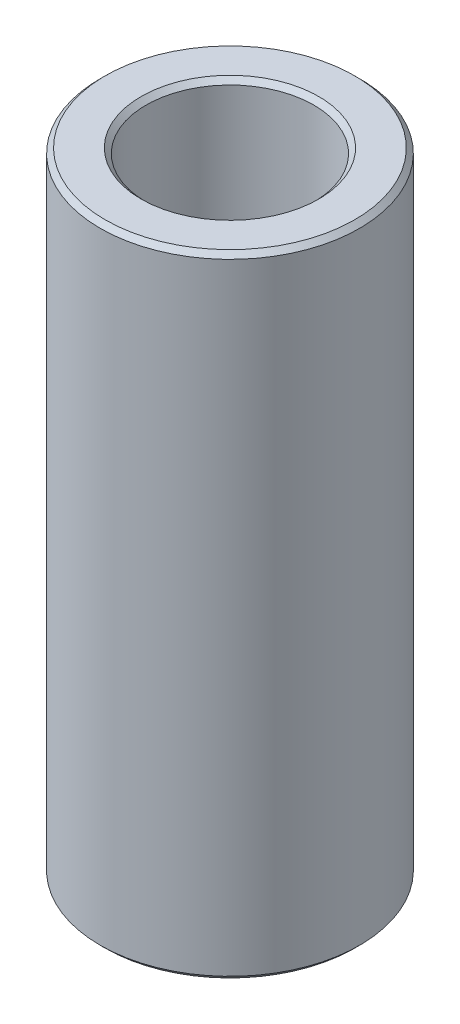
ISO-10303-21;
HEADER;
FILE_DESCRIPTION(('STEP AP214'),'2;1');
FILE_NAME('part.step','',(''),(''),'','','');
FILE_SCHEMA(('AUTOMOTIVE_DESIGN { 1 0 10303 214 1 1 1 1 }'));
ENDSEC;
DATA;
#1=APPLICATION_CONTEXT('core data for automotive mechanical design processes');
#2=APPLICATION_PROTOCOL_DEFINITION('international standard','automotive_design',2000,#1);
#3=PRODUCT_CONTEXT('',#1,'mechanical');
#4=PRODUCT('Part','Part','',(#3));
#5=PRODUCT_RELATED_PRODUCT_CATEGORY('part','',(#4));
#6=PRODUCT_DEFINITION_FORMATION('','',#4);
#7=PRODUCT_DEFINITION_CONTEXT('part definition',#1,'design');
#8=PRODUCT_DEFINITION('design','',#6,#7);
#9=PRODUCT_DEFINITION_SHAPE('','',#8);
#10=(LENGTH_UNIT() NAMED_UNIT(*) SI_UNIT(.MILLI.,.METRE.));
#11=(NAMED_UNIT(*) PLANE_ANGLE_UNIT() SI_UNIT($,.RADIAN.));
#12=(NAMED_UNIT(*) SI_UNIT($,.STERADIAN.) SOLID_ANGLE_UNIT());
#13=UNCERTAINTY_MEASURE_WITH_UNIT(LENGTH_MEASURE(1.E-05),#10,'distance_accuracy_value','');
#14=(GEOMETRIC_REPRESENTATION_CONTEXT(3) GLOBAL_UNCERTAINTY_ASSIGNED_CONTEXT((#13)) GLOBAL_UNIT_ASSIGNED_CONTEXT((#10,
#11,#12)) REPRESENTATION_CONTEXT('',''));
#15=CARTESIAN_POINT('',(0.,0.,0.));
#16=DIRECTION('',(0.,0.,1.));
#17=DIRECTION('',(1.,0.,0.));
#18=AXIS2_PLACEMENT_3D('',#15,#16,#17);
#19=CARTESIAN_POINT('',(0.,279.66699871967,0.));
#20=DIRECTION('',(0.,-1.,0.));
#21=DIRECTION('',(0.,0.,-1.));
#22=AXIS2_PLACEMENT_3D('',#19,#20,#21);
#23=CYLINDRICAL_SURFACE('',#22,57.5);
#24=CARTESIAN_POINT('',(0.,2.19095444456258,0.));
#25=DIRECTION('',(0.,1.,0.));
#26=DIRECTION('',(0.,0.,1.));
#27=AXIS2_PLACEMENT_3D('',#24,#25,#26);
#28=CIRCLE('',#27,57.5);
#29=CARTESIAN_POINT('',(0.,2.19095444456258,57.5));
#30=VERTEX_POINT('',#29);
#31=EDGE_CURVE('E10',#30,#30,#28,.T.);
#32=ORIENTED_EDGE('',*,*,#31,.T.);
#33=EDGE_LOOP('',(#32));
#34=FACE_BOUND('',#33,.T.);
#35=CARTESIAN_POINT('',(0.,277.476044275108,0.));
#36=DIRECTION('',(0.,1.,0.));
#37=DIRECTION('',(0.,0.,1.));
#38=AXIS2_PLACEMENT_3D('',#35,#36,#37);
#39=CIRCLE('',#38,57.5);
#40=CARTESIAN_POINT('',(0.,277.476044275108,57.5));
#41=VERTEX_POINT('',#40);
#42=EDGE_CURVE('E50',#41,#41,#39,.F.);
#43=ORIENTED_EDGE('',*,*,#42,.T.);
#44=EDGE_LOOP('',(#43));
#45=FACE_BOUND('',#44,.T.);
#46=ADVANCED_FACE('F39',(#34,#45),#23,.T.);
#47=CARTESIAN_POINT('',(0.,279.66699871967,0.));
#48=DIRECTION('',(0.,1.,0.));
#49=DIRECTION('',(0.,0.,1.));
#50=AXIS2_PLACEMENT_3D('',#47,#48,#49);
#51=PLANE('',#50);
#52=CARTESIAN_POINT('',(0.,279.66699871967,0.));
#53=DIRECTION('',(0.,1.,0.));
#54=DIRECTION('',(0.,0.,1.));
#55=AXIS2_PLACEMENT_3D('',#52,#53,#54);
#56=CIRCLE('',#55,39.3945971614081);
#57=CARTESIAN_POINT('',(0.,279.66699871967,39.3945971614081));
#58=VERTEX_POINT('',#57);
#59=EDGE_CURVE('E58',#58,#58,#56,.F.);
#60=ORIENTED_EDGE('',*,*,#59,.T.);
#61=EDGE_LOOP('',(#60));
#62=FACE_BOUND('',#61,.T.);
#63=CARTESIAN_POINT('',(0.,279.66699871967,0.));
#64=DIRECTION('',(0.,1.,0.));
#65=DIRECTION('',(0.,0.,1.));
#66=AXIS2_PLACEMENT_3D('',#63,#64,#65);
#67=CIRCLE('',#66,55.3090455554375);
#68=CARTESIAN_POINT('',(0.,279.66699871967,55.3090455554375));
#69=VERTEX_POINT('',#68);
#70=EDGE_CURVE('E61',#69,#69,#67,.T.);
#71=ORIENTED_EDGE('',*,*,#70,.T.);
#72=EDGE_LOOP('',(#71));
#73=FACE_BOUND('',#72,.T.);
#74=ADVANCED_FACE('F88',(#62,#73),#51,.T.);
#75=CARTESIAN_POINT('',(0.,0.,0.));
#76=DIRECTION('',(0.,1.,0.));
#77=DIRECTION('',(0.,0.,1.));
#78=AXIS2_PLACEMENT_3D('',#75,#76,#77);
#79=PLANE('',#78);
#80=CARTESIAN_POINT('',(0.,0.,0.));
#81=DIRECTION('',(0.,1.,0.));
#82=DIRECTION('',(0.,0.,1.));
#83=AXIS2_PLACEMENT_3D('',#80,#81,#82);
#84=CIRCLE('',#83,39.3945971614081);
#85=CARTESIAN_POINT('',(0.,0.,39.3945971614081));
#86=VERTEX_POINT('',#85);
#87=EDGE_CURVE('E51',#86,#86,#84,.T.);
#88=ORIENTED_EDGE('',*,*,#87,.T.);
#89=EDGE_LOOP('',(#88));
#90=FACE_BOUND('',#89,.T.);
#91=CARTESIAN_POINT('',(0.,0.,0.));
#92=DIRECTION('',(0.,1.,0.));
#93=DIRECTION('',(0.,0.,1.));
#94=AXIS2_PLACEMENT_3D('',#91,#92,#93);
#95=CIRCLE('',#94,55.3090455554374);
#96=CARTESIAN_POINT('',(0.,0.,55.3090455554374));
#97=VERTEX_POINT('',#96);
#98=EDGE_CURVE('E54',#97,#97,#95,.F.);
#99=ORIENTED_EDGE('',*,*,#98,.T.);
#100=EDGE_LOOP('',(#99));
#101=FACE_BOUND('',#100,.T.);
#102=ADVANCED_FACE('F83',(#90,#101),#79,.F.);
#103=CARTESIAN_POINT('',(0.,279.66699871967,0.));
#104=DIRECTION('',(0.,-1.,0.));
#105=DIRECTION('',(0.,0.,-1.));
#106=AXIS2_PLACEMENT_3D('',#103,#104,#105);
#107=CYLINDRICAL_SURFACE('',#106,37.2036427168455);
#108=CARTESIAN_POINT('',(0.,277.476044275108,0.));
#109=DIRECTION('',(0.,1.,0.));
#110=DIRECTION('',(0.,0.,1.));
#111=AXIS2_PLACEMENT_3D('',#108,#109,#110);
#112=CIRCLE('',#111,37.2036427168455);
#113=CARTESIAN_POINT('',(0.,277.476044275108,37.2036427168455));
#114=VERTEX_POINT('',#113);
#115=EDGE_CURVE('E67',#114,#114,#112,.T.);
#116=ORIENTED_EDGE('',*,*,#115,.T.);
#117=EDGE_LOOP('',(#116));
#118=FACE_BOUND('',#117,.T.);
#119=CARTESIAN_POINT('',(0.,2.19095444456258,0.));
#120=DIRECTION('',(0.,1.,0.));
#121=DIRECTION('',(0.,0.,1.));
#122=AXIS2_PLACEMENT_3D('',#119,#120,#121);
#123=CIRCLE('',#122,37.2036427168455);
#124=CARTESIAN_POINT('',(0.,2.19095444456258,37.2036427168455));
#125=VERTEX_POINT('',#124);
#126=EDGE_CURVE('E69',#125,#125,#123,.F.);
#127=ORIENTED_EDGE('',*,*,#126,.T.);
#128=EDGE_LOOP('',(#127));
#129=FACE_BOUND('',#128,.T.);
#130=ADVANCED_FACE('F71',(#118,#129),#107,.F.);
#131=CARTESIAN_POINT('',(0.,277.476044275108,0.));
#132=DIRECTION('',(0.,1.,0.));
#133=DIRECTION('',(0.,0.,1.));
#134=AXIS2_PLACEMENT_3D('',#131,#132,#133);
#135=CONICAL_SURFACE('',#134,37.2036427168455,0.785398163397445);
#136=ORIENTED_EDGE('',*,*,#59,.F.);
#137=EDGE_LOOP('',(#136));
#138=FACE_BOUND('',#137,.T.);
#139=ORIENTED_EDGE('',*,*,#115,.F.);
#140=EDGE_LOOP('',(#139));
#141=FACE_BOUND('',#140,.T.);
#142=ADVANCED_FACE('F77',(#138,#141),#135,.F.);
#143=CARTESIAN_POINT('',(0.,0.,0.));
#144=DIRECTION('',(0.,-1.,0.));
#145=DIRECTION('',(0.,0.,-1.));
#146=AXIS2_PLACEMENT_3D('',#143,#144,#145);
#147=CONICAL_SURFACE('',#146,39.3945971614081,0.785398163397458);
#148=ORIENTED_EDGE('',*,*,#126,.F.);
#149=EDGE_LOOP('',(#148));
#150=FACE_BOUND('',#149,.T.);
#151=ORIENTED_EDGE('',*,*,#87,.F.);
#152=EDGE_LOOP('',(#151));
#153=FACE_BOUND('',#152,.T.);
#154=ADVANCED_FACE('F73',(#150,#153),#147,.F.);
#155=CARTESIAN_POINT('',(0.,2.19095444456258,0.));
#156=DIRECTION('',(0.,1.,0.));
#157=DIRECTION('',(0.,0.,1.));
#158=AXIS2_PLACEMENT_3D('',#155,#156,#157);
#159=CONICAL_SURFACE('',#158,57.5,0.785398163397455);
#160=ORIENTED_EDGE('',*,*,#98,.F.);
#161=EDGE_LOOP('',(#160));
#162=FACE_BOUND('',#161,.T.);
#163=ORIENTED_EDGE('',*,*,#31,.F.);
#164=EDGE_LOOP('',(#163));
#165=FACE_BOUND('',#164,.T.);
#166=ADVANCED_FACE('F76',(#162,#165),#159,.T.);
#167=CARTESIAN_POINT('',(0.,279.66699871967,0.));
#168=DIRECTION('',(0.,-1.,0.));
#169=DIRECTION('',(0.,0.,-1.));
#170=AXIS2_PLACEMENT_3D('',#167,#168,#169);
#171=CONICAL_SURFACE('',#170,55.3090455554375,0.785398163397456);
#172=ORIENTED_EDGE('',*,*,#42,.F.);
#173=EDGE_LOOP('',(#172));
#174=FACE_BOUND('',#173,.T.);
#175=ORIENTED_EDGE('',*,*,#70,.F.);
#176=EDGE_LOOP('',(#175));
#177=FACE_BOUND('',#176,.T.);
#178=ADVANCED_FACE('F45',(#174,#177),#171,.T.);
#179=CLOSED_SHELL('',(#46,#74,#102,#130,#142,#154,#166,#178));
#180=MANIFOLD_SOLID_BREP('B2',#179);
#181=ADVANCED_BREP_SHAPE_REPRESENTATION('',(#18,#180),#14);
#182=SHAPE_DEFINITION_REPRESENTATION(#9,#181);
ENDSEC;
END-ISO-10303-21;
